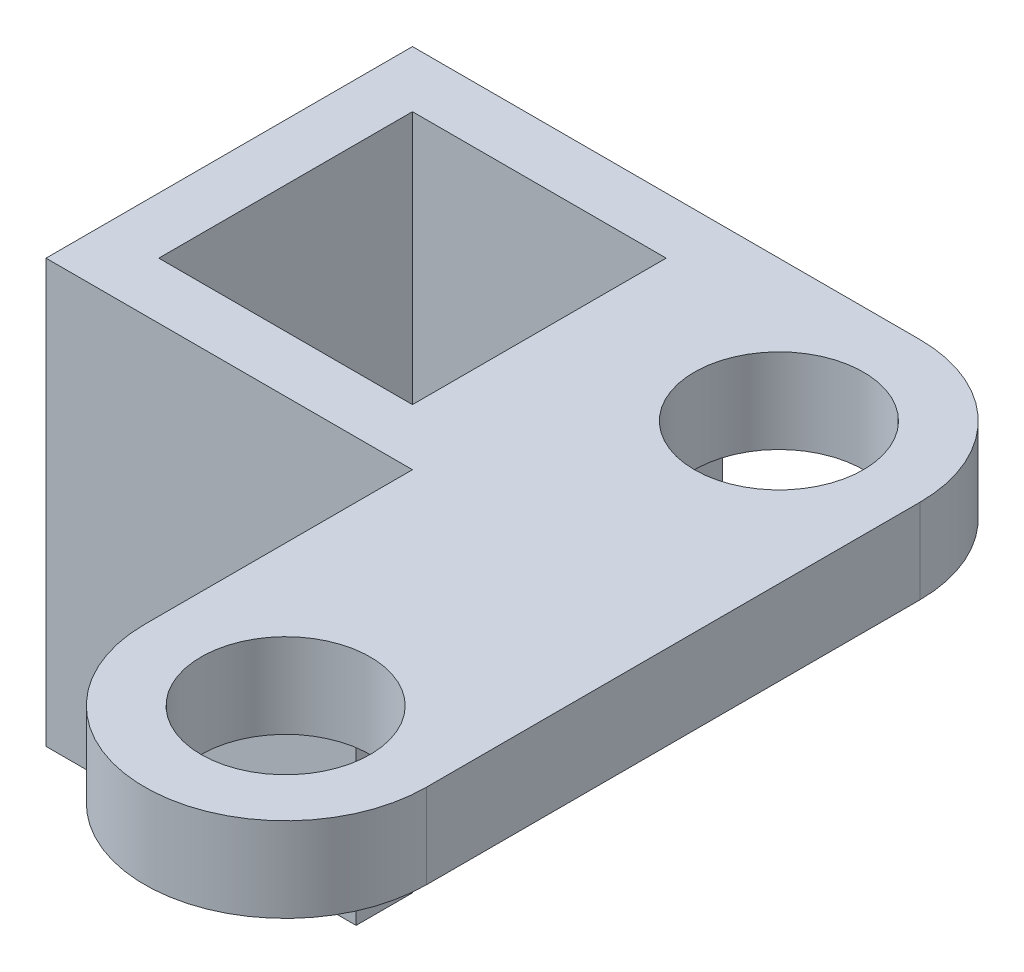
ISO-10303-21;
HEADER;
FILE_DESCRIPTION(('STEP AP214'),'2;1');
FILE_NAME('part.step','',(''),(''),'','','');
FILE_SCHEMA(('AUTOMOTIVE_DESIGN { 1 0 10303 214 1 1 1 1 }'));
ENDSEC;
DATA;
#1=APPLICATION_CONTEXT('core data for automotive mechanical design processes');
#2=APPLICATION_PROTOCOL_DEFINITION('international standard','automotive_design',2000,#1);
#3=PRODUCT_CONTEXT('',#1,'mechanical');
#4=PRODUCT('Part','Part','',(#3));
#5=PRODUCT_RELATED_PRODUCT_CATEGORY('part','',(#4));
#6=PRODUCT_DEFINITION_FORMATION('','',#4);
#7=PRODUCT_DEFINITION_CONTEXT('part definition',#1,'design');
#8=PRODUCT_DEFINITION('design','',#6,#7);
#9=PRODUCT_DEFINITION_SHAPE('','',#8);
#10=(LENGTH_UNIT() NAMED_UNIT(*) SI_UNIT(.MILLI.,.METRE.));
#11=(NAMED_UNIT(*) PLANE_ANGLE_UNIT() SI_UNIT($,.RADIAN.));
#12=(NAMED_UNIT(*) SI_UNIT($,.STERADIAN.) SOLID_ANGLE_UNIT());
#13=UNCERTAINTY_MEASURE_WITH_UNIT(LENGTH_MEASURE(1.E-05),#10,'distance_accuracy_value','');
#14=(GEOMETRIC_REPRESENTATION_CONTEXT(3) GLOBAL_UNCERTAINTY_ASSIGNED_CONTEXT((#13)) GLOBAL_UNIT_ASSIGNED_CONTEXT((#10,
#11,#12)) REPRESENTATION_CONTEXT('',''));
#15=CARTESIAN_POINT('',(0.,0.,0.));
#16=DIRECTION('',(0.,0.,1.));
#17=DIRECTION('',(1.,0.,0.));
#18=AXIS2_PLACEMENT_3D('',#15,#16,#17);
#19=CARTESIAN_POINT('',(1.73026563534961,3.,-9.65427227262373));
#20=DIRECTION('',(0.,-1.,0.));
#21=DIRECTION('',(0.,0.,-1.));
#22=AXIS2_PLACEMENT_3D('',#19,#20,#21);
#23=CYLINDRICAL_SURFACE('',#22,5.);
#24=DIRECTION('',(0.,-1.,0.));
#25=VECTOR('',#24,1.);
#26=CARTESIAN_POINT('',(1.73026563534961,3.,-14.6542722726237));
#27=LINE('',#26,#25);
#28=CARTESIAN_POINT('',(1.73026563534961,3.,-14.6542722726237));
#29=VERTEX_POINT('',#28);
#30=CARTESIAN_POINT('',(1.73026563534961,0.,-14.6542722726237));
#31=VERTEX_POINT('',#30);
#32=EDGE_CURVE('E58',#29,#31,#27,.T.);
#33=ORIENTED_EDGE('',*,*,#32,.F.);
#34=CARTESIAN_POINT('',(1.73026563534961,3.,-9.65427227262373));
#35=DIRECTION('',(0.,1.,0.));
#36=DIRECTION('',(0.,0.,-1.));
#37=AXIS2_PLACEMENT_3D('',#34,#35,#36);
#38=CIRCLE('',#37,5.);
#39=CARTESIAN_POINT('',(6.73026563534961,3.,-9.65427227262373));
#40=VERTEX_POINT('',#39);
#41=EDGE_CURVE('E247',#40,#29,#38,.T.);
#42=ORIENTED_EDGE('',*,*,#41,.F.);
#43=DIRECTION('',(0.,-1.,0.));
#44=VECTOR('',#43,1.);
#45=CARTESIAN_POINT('',(6.73026563534961,3.,-9.65427227262373));
#46=LINE('',#45,#44);
#47=CARTESIAN_POINT('',(6.73026563534961,0.,-9.65427227262373));
#48=VERTEX_POINT('',#47);
#49=EDGE_CURVE('E42',#40,#48,#46,.T.);
#50=ORIENTED_EDGE('',*,*,#49,.T.);
#51=CARTESIAN_POINT('',(1.73026563534961,0.,-9.65427227262373));
#52=DIRECTION('',(0.,1.,0.));
#53=DIRECTION('',(0.,0.,-1.));
#54=AXIS2_PLACEMENT_3D('',#51,#52,#53);
#55=CIRCLE('',#54,5.);
#56=EDGE_CURVE('E244',#48,#31,#55,.T.);
#57=ORIENTED_EDGE('',*,*,#56,.T.);
#58=EDGE_LOOP('',(#33,#42,#50,#57));
#59=FACE_BOUND('',#58,.T.);
#60=ADVANCED_FACE('F33',(#59),#23,.T.);
#61=CARTESIAN_POINT('',(1.73026563534961,3.,7.84572772737627));
#62=DIRECTION('',(0.,-1.,0.));
#63=DIRECTION('',(0.,0.,-1.));
#64=AXIS2_PLACEMENT_3D('',#61,#62,#63);
#65=PLANE('',#64);
#66=CARTESIAN_POINT('',(1.73026563534961,3.,-9.65427227262373));
#67=DIRECTION('',(0.,1.,0.));
#68=DIRECTION('',(0.,0.,1.));
#69=AXIS2_PLACEMENT_3D('',#66,#67,#68);
#70=CIRCLE('',#69,3.);
#71=CARTESIAN_POINT('',(1.73026563534961,3.,-6.65427227262373));
#72=VERTEX_POINT('',#71);
#73=EDGE_CURVE('E268',#72,#72,#70,.T.);
#74=ORIENTED_EDGE('',*,*,#73,.F.);
#75=EDGE_LOOP('',(#74));
#76=FACE_BOUND('',#75,.T.);
#77=CARTESIAN_POINT('',(1.73026563534961,3.,7.84572772737627));
#78=DIRECTION('',(0.,1.,0.));
#79=DIRECTION('',(0.,0.,-1.));
#80=AXIS2_PLACEMENT_3D('',#77,#78,#79);
#81=CIRCLE('',#80,5.);
#82=CARTESIAN_POINT('',(-3.26973436465039,3.,7.84572772737627));
#83=VERTEX_POINT('',#82);
#84=CARTESIAN_POINT('',(6.73026563534961,3.,7.84572772737627));
#85=VERTEX_POINT('',#84);
#86=EDGE_CURVE('E253',#83,#85,#81,.T.);
#87=ORIENTED_EDGE('',*,*,#86,.T.);
#88=DIRECTION('',(0.,0.,-1.));
#89=VECTOR('',#88,1.);
#90=CARTESIAN_POINT('',(6.73026563534961,3.,-9.65427227262373));
#91=LINE('',#90,#89);
#92=EDGE_CURVE('E289',#85,#40,#91,.T.);
#93=ORIENTED_EDGE('',*,*,#92,.T.);
#94=ORIENTED_EDGE('',*,*,#41,.T.);
#95=DIRECTION('',(1.,0.,0.));
#96=VECTOR('',#95,1.);
#97=CARTESIAN_POINT('',(1.73026563534961,3.,-14.6542722726237));
#98=LINE('',#97,#96);
#99=CARTESIAN_POINT('',(-16.2697343646504,3.,-14.6542722726237));
#100=VERTEX_POINT('',#99);
#101=EDGE_CURVE('E263',#100,#29,#98,.T.);
#102=ORIENTED_EDGE('',*,*,#101,.F.);
#103=DIRECTION('',(0.,0.,-1.));
#104=VECTOR('',#103,1.);
#105=CARTESIAN_POINT('',(-16.2697343646504,3.,-14.6542722726237));
#106=LINE('',#105,#104);
#107=CARTESIAN_POINT('',(-16.2697343646504,3.,-1.65427227262373));
#108=VERTEX_POINT('',#107);
#109=EDGE_CURVE('E326',#108,#100,#106,.T.);
#110=ORIENTED_EDGE('',*,*,#109,.F.);
#111=DIRECTION('',(-1.,0.,0.));
#112=VECTOR('',#111,1.);
#113=CARTESIAN_POINT('',(-16.2697343646504,3.,-1.65427227262373));
#114=LINE('',#113,#112);
#115=CARTESIAN_POINT('',(-3.26973436465039,3.,-1.65427227262373));
#116=VERTEX_POINT('',#115);
#117=EDGE_CURVE('E325',#116,#108,#114,.T.);
#118=ORIENTED_EDGE('',*,*,#117,.F.);
#119=DIRECTION('',(0.,0.,1.));
#120=VECTOR('',#119,1.);
#121=CARTESIAN_POINT('',(-3.26973436465039,3.,7.84572772737627));
#122=LINE('',#121,#120);
#123=EDGE_CURVE('E258',#116,#83,#122,.T.);
#124=ORIENTED_EDGE('',*,*,#123,.T.);
#125=EDGE_LOOP('',(#87,#93,#94,#102,#110,#118,#124));
#126=FACE_BOUND('',#125,.T.);
#127=CARTESIAN_POINT('',(1.73026563534961,3.,7.84572772737627));
#128=DIRECTION('',(0.,1.,0.));
#129=DIRECTION('',(0.,0.,1.));
#130=AXIS2_PLACEMENT_3D('',#127,#128,#129);
#131=CIRCLE('',#130,3.);
#132=CARTESIAN_POINT('',(1.73026563534961,3.,10.8457277273763));
#133=VERTEX_POINT('',#132);
#134=EDGE_CURVE('E282',#133,#133,#131,.T.);
#135=ORIENTED_EDGE('',*,*,#134,.F.);
#136=EDGE_LOOP('',(#135));
#137=FACE_BOUND('',#136,.T.);
#138=DIRECTION('',(-1.,0.,0.));
#139=VECTOR('',#138,1.);
#140=CARTESIAN_POINT('',(-5.26973436465039,3.,-3.65427227262373));
#141=LINE('',#140,#139);
#142=CARTESIAN_POINT('',(-5.26973436465039,3.,-3.65427227262373));
#143=VERTEX_POINT('',#142);
#144=CARTESIAN_POINT('',(-14.2697343646504,3.,-3.65427227262373));
#145=VERTEX_POINT('',#144);
#146=EDGE_CURVE('E152',#143,#145,#141,.T.);
#147=ORIENTED_EDGE('',*,*,#146,.T.);
#148=DIRECTION('',(0.,0.,-1.));
#149=VECTOR('',#148,1.);
#150=CARTESIAN_POINT('',(-14.2697343646504,3.,-3.65427227262373));
#151=LINE('',#150,#149);
#152=CARTESIAN_POINT('',(-14.2697343646504,3.,-12.6542722726237));
#153=VERTEX_POINT('',#152);
#154=EDGE_CURVE('E317',#145,#153,#151,.T.);
#155=ORIENTED_EDGE('',*,*,#154,.T.);
#156=DIRECTION('',(1.,0.,0.));
#157=VECTOR('',#156,1.);
#158=CARTESIAN_POINT('',(-5.26973436465039,3.,-12.6542722726237));
#159=LINE('',#158,#157);
#160=CARTESIAN_POINT('',(-5.26973436465039,3.,-12.6542722726237));
#161=VERTEX_POINT('',#160);
#162=EDGE_CURVE('E147',#153,#161,#159,.T.);
#163=ORIENTED_EDGE('',*,*,#162,.T.);
#164=DIRECTION('',(0.,0.,1.));
#165=VECTOR('',#164,1.);
#166=CARTESIAN_POINT('',(-5.26973436465039,3.,-3.65427227262373));
#167=LINE('',#166,#165);
#168=EDGE_CURVE('E492',#161,#143,#167,.T.);
#169=ORIENTED_EDGE('',*,*,#168,.T.);
#170=EDGE_LOOP('',(#147,#155,#163,#169));
#171=FACE_BOUND('',#170,.T.);
#172=ADVANCED_FACE('F216',(#76,#126,#137,#171),#65,.F.);
#173=CARTESIAN_POINT('',(1.73026563534961,0.,7.84572772737627));
#174=DIRECTION('',(0.,-1.,0.));
#175=DIRECTION('',(0.,0.,-1.));
#176=AXIS2_PLACEMENT_3D('',#173,#174,#175);
#177=PLANE('',#176);
#178=DIRECTION('',(0.,0.,1.));
#179=VECTOR('',#178,1.);
#180=CARTESIAN_POINT('',(-5.26973436465039,0.,-12.6542722726237));
#181=LINE('',#180,#179);
#182=CARTESIAN_POINT('',(-5.26973436465039,0.,-14.6542722726237));
#183=VERTEX_POINT('',#182);
#184=CARTESIAN_POINT('',(-5.26973436465039,0.,-12.6542722726237));
#185=VERTEX_POINT('',#184);
#186=EDGE_CURVE('E50',#183,#185,#181,.T.);
#187=ORIENTED_EDGE('',*,*,#186,.F.);
#188=DIRECTION('',(1.,0.,0.));
#189=VECTOR('',#188,1.);
#190=CARTESIAN_POINT('',(1.73026563534961,0.,-14.6542722726237));
#191=LINE('',#190,#189);
#192=EDGE_CURVE('E190',#183,#31,#191,.T.);
#193=ORIENTED_EDGE('',*,*,#192,.T.);
#194=ORIENTED_EDGE('',*,*,#56,.F.);
#195=DIRECTION('',(0.,0.,-1.));
#196=VECTOR('',#195,1.);
#197=CARTESIAN_POINT('',(6.73026563534961,0.,-9.65427227262373));
#198=LINE('',#197,#196);
#199=CARTESIAN_POINT('',(6.73026563534961,0.,7.84572772737627));
#200=VERTEX_POINT('',#199);
#201=EDGE_CURVE('E238',#200,#48,#198,.T.);
#202=ORIENTED_EDGE('',*,*,#201,.F.);
#203=CARTESIAN_POINT('',(1.73026563534961,0.,7.84572772737627));
#204=DIRECTION('',(0.,1.,0.));
#205=DIRECTION('',(0.,0.,-1.));
#206=AXIS2_PLACEMENT_3D('',#203,#204,#205);
#207=CIRCLE('',#206,5.);
#208=CARTESIAN_POINT('',(-3.26973436465039,0.,7.84572772737627));
#209=VERTEX_POINT('',#208);
#210=EDGE_CURVE('E245',#209,#200,#207,.T.);
#211=ORIENTED_EDGE('',*,*,#210,.F.);
#212=DIRECTION('',(0.,0.,1.));
#213=VECTOR('',#212,1.);
#214=CARTESIAN_POINT('',(-3.26973436465039,0.,7.84572772737627));
#215=LINE('',#214,#213);
#216=CARTESIAN_POINT('',(-3.26973436465039,0.,-1.65427227262373));
#217=VERTEX_POINT('',#216);
#218=EDGE_CURVE('E251',#217,#209,#215,.T.);
#219=ORIENTED_EDGE('',*,*,#218,.F.);
#220=DIRECTION('',(-1.,0.,0.));
#221=VECTOR('',#220,1.);
#222=CARTESIAN_POINT('',(-16.2697343646504,0.,-1.65427227262373));
#223=LINE('',#222,#221);
#224=CARTESIAN_POINT('',(-5.26973436465039,0.,-1.65427227262373));
#225=VERTEX_POINT('',#224);
#226=EDGE_CURVE('E259',#217,#225,#223,.T.);
#227=ORIENTED_EDGE('',*,*,#226,.T.);
#228=DIRECTION('',(0.,0.,1.));
#229=VECTOR('',#228,1.);
#230=CARTESIAN_POINT('',(-5.26973436465039,0.,-1.65427227262373));
#231=LINE('',#230,#229);
#232=CARTESIAN_POINT('',(-5.26973436465039,0.,-3.65427227262373));
#233=VERTEX_POINT('',#232);
#234=EDGE_CURVE('E167',#233,#225,#231,.T.);
#235=ORIENTED_EDGE('',*,*,#234,.F.);
#236=DIRECTION('',(0.,0.,1.));
#237=VECTOR('',#236,1.);
#238=CARTESIAN_POINT('',(-5.26973436465039,0.,-3.65427227262373));
#239=LINE('',#238,#237);
#240=EDGE_CURVE('E307',#185,#233,#239,.T.);
#241=ORIENTED_EDGE('',*,*,#240,.F.);
#242=EDGE_LOOP('',(#187,#193,#194,#202,#211,#219,#227,#235,#241));
#243=FACE_BOUND('',#242,.T.);
#244=CARTESIAN_POINT('',(1.73026563534961,0.,-9.65427227262373));
#245=DIRECTION('',(0.,1.,0.));
#246=DIRECTION('',(0.,0.,1.));
#247=AXIS2_PLACEMENT_3D('',#244,#245,#246);
#248=CIRCLE('',#247,3.);
#249=CARTESIAN_POINT('',(1.73026563534961,0.,-6.65427227262373));
#250=VERTEX_POINT('',#249);
#251=EDGE_CURVE('E276',#250,#250,#248,.T.);
#252=ORIENTED_EDGE('',*,*,#251,.T.);
#253=EDGE_LOOP('',(#252));
#254=FACE_BOUND('',#253,.T.);
#255=CARTESIAN_POINT('',(1.73026563534961,0.,7.84572772737627));
#256=DIRECTION('',(0.,1.,0.));
#257=DIRECTION('',(0.,0.,1.));
#258=AXIS2_PLACEMENT_3D('',#255,#256,#257);
#259=CIRCLE('',#258,3.);
#260=CARTESIAN_POINT('',(1.73026563534961,0.,10.8457277273763));
#261=VERTEX_POINT('',#260);
#262=EDGE_CURVE('E279',#261,#261,#259,.T.);
#263=ORIENTED_EDGE('',*,*,#262,.T.);
#264=EDGE_LOOP('',(#263));
#265=FACE_BOUND('',#264,.T.);
#266=ADVANCED_FACE('F221',(#243,#254,#265),#177,.T.);
#267=CARTESIAN_POINT('',(1.73026563534961,3.,7.84572772737627));
#268=DIRECTION('',(0.,-1.,0.));
#269=DIRECTION('',(0.,0.,-1.));
#270=AXIS2_PLACEMENT_3D('',#267,#268,#269);
#271=CYLINDRICAL_SURFACE('',#270,5.);
#272=ORIENTED_EDGE('',*,*,#210,.T.);
#273=DIRECTION('',(0.,-1.,0.));
#274=VECTOR('',#273,1.);
#275=CARTESIAN_POINT('',(6.73026563534961,3.,7.84572772737627));
#276=LINE('',#275,#274);
#277=EDGE_CURVE('E11',#85,#200,#276,.T.);
#278=ORIENTED_EDGE('',*,*,#277,.F.);
#279=ORIENTED_EDGE('',*,*,#86,.F.);
#280=DIRECTION('',(0.,-1.,0.));
#281=VECTOR('',#280,1.);
#282=CARTESIAN_POINT('',(-3.26973436465039,3.,7.84572772737627));
#283=LINE('',#282,#281);
#284=EDGE_CURVE('E248',#83,#209,#283,.T.);
#285=ORIENTED_EDGE('',*,*,#284,.T.);
#286=EDGE_LOOP('',(#272,#278,#279,#285));
#287=FACE_BOUND('',#286,.T.);
#288=ADVANCED_FACE('F35',(#287),#271,.T.);
#289=CARTESIAN_POINT('',(6.73026563534961,3.,-9.65427227262373));
#290=DIRECTION('',(-1.,0.,0.));
#291=DIRECTION('',(0.,0.,1.));
#292=AXIS2_PLACEMENT_3D('',#289,#290,#291);
#293=PLANE('',#292);
#294=ORIENTED_EDGE('',*,*,#201,.T.);
#295=ORIENTED_EDGE('',*,*,#49,.F.);
#296=ORIENTED_EDGE('',*,*,#92,.F.);
#297=ORIENTED_EDGE('',*,*,#277,.T.);
#298=EDGE_LOOP('',(#294,#295,#296,#297));
#299=FACE_BOUND('',#298,.T.);
#300=ADVANCED_FACE('F227',(#299),#293,.F.);
#301=CARTESIAN_POINT('',(-3.26973436465039,3.,7.84572772737627));
#302=DIRECTION('',(1.,0.,0.));
#303=DIRECTION('',(0.,0.,-1.));
#304=AXIS2_PLACEMENT_3D('',#301,#302,#303);
#305=PLANE('',#304);
#306=ORIENTED_EDGE('',*,*,#123,.F.);
#307=DIRECTION('',(0.,-1.,0.));
#308=VECTOR('',#307,1.);
#309=CARTESIAN_POINT('',(-3.26973436465039,3.,-1.65427227262373));
#310=LINE('',#309,#308);
#311=EDGE_CURVE('E273',#116,#217,#310,.T.);
#312=ORIENTED_EDGE('',*,*,#311,.T.);
#313=ORIENTED_EDGE('',*,*,#218,.T.);
#314=ORIENTED_EDGE('',*,*,#284,.F.);
#315=EDGE_LOOP('',(#306,#312,#313,#314));
#316=FACE_BOUND('',#315,.T.);
#317=ADVANCED_FACE('F225',(#316),#305,.F.);
#318=CARTESIAN_POINT('',(1.73026563534961,3.,7.84572772737627));
#319=DIRECTION('',(0.,-1.,0.));
#320=DIRECTION('',(0.,0.,-1.));
#321=AXIS2_PLACEMENT_3D('',#318,#319,#320);
#322=CYLINDRICAL_SURFACE('',#321,3.);
#323=ORIENTED_EDGE('',*,*,#134,.T.);
#324=EDGE_LOOP('',(#323));
#325=FACE_BOUND('',#324,.T.);
#326=ORIENTED_EDGE('',*,*,#262,.F.);
#327=EDGE_LOOP('',(#326));
#328=FACE_BOUND('',#327,.T.);
#329=ADVANCED_FACE('F234',(#325,#328),#322,.F.);
#330=CARTESIAN_POINT('',(1.73026563534961,0.,-9.65427227262373));
#331=DIRECTION('',(0.,1.,0.));
#332=DIRECTION('',(0.,0.,1.));
#333=AXIS2_PLACEMENT_3D('',#330,#331,#332);
#334=CYLINDRICAL_SURFACE('',#333,3.);
#335=ORIENTED_EDGE('',*,*,#251,.F.);
#336=EDGE_LOOP('',(#335));
#337=FACE_BOUND('',#336,.T.);
#338=ORIENTED_EDGE('',*,*,#73,.T.);
#339=EDGE_LOOP('',(#338));
#340=FACE_BOUND('',#339,.T.);
#341=ADVANCED_FACE('F346',(#337,#340),#334,.F.);
#342=CARTESIAN_POINT('',(1.73026563534961,3.,-14.6542722726237));
#343=DIRECTION('',(0.,0.,-1.));
#344=DIRECTION('',(-1.,0.,0.));
#345=AXIS2_PLACEMENT_3D('',#342,#343,#344);
#346=PLANE('',#345);
#347=ORIENTED_EDGE('',*,*,#192,.F.);
#348=DIRECTION('',(0.,1.,0.));
#349=VECTOR('',#348,1.);
#350=CARTESIAN_POINT('',(-5.26973436465039,-12.,-14.6542722726237));
#351=LINE('',#350,#349);
#352=CARTESIAN_POINT('',(-5.26973436465039,-12.,-14.6542722726237));
#353=VERTEX_POINT('',#352);
#354=EDGE_CURVE('E197',#353,#183,#351,.T.);
#355=ORIENTED_EDGE('',*,*,#354,.F.);
#356=DIRECTION('',(1.,0.,0.));
#357=VECTOR('',#356,1.);
#358=CARTESIAN_POINT('',(-5.26973436465039,-12.,-14.6542722726237));
#359=LINE('',#358,#357);
#360=CARTESIAN_POINT('',(-16.2697343646504,-12.,-14.6542722726237));
#361=VERTEX_POINT('',#360);
#362=EDGE_CURVE('E179',#361,#353,#359,.T.);
#363=ORIENTED_EDGE('',*,*,#362,.F.);
#364=DIRECTION('',(0.,-1.,0.));
#365=VECTOR('',#364,1.);
#366=CARTESIAN_POINT('',(-16.2697343646504,3.,-14.6542722726237));
#367=LINE('',#366,#365);
#368=EDGE_CURVE('E269',#100,#361,#367,.T.);
#369=ORIENTED_EDGE('',*,*,#368,.F.);
#370=ORIENTED_EDGE('',*,*,#101,.T.);
#371=ORIENTED_EDGE('',*,*,#32,.T.);
#372=EDGE_LOOP('',(#347,#355,#363,#369,#370,#371));
#373=FACE_BOUND('',#372,.T.);
#374=ADVANCED_FACE('F333',(#373),#346,.T.);
#375=CARTESIAN_POINT('',(-16.2697343646504,3.,-14.6542722726237));
#376=DIRECTION('',(-1.,0.,0.));
#377=DIRECTION('',(0.,0.,1.));
#378=AXIS2_PLACEMENT_3D('',#375,#376,#377);
#379=PLANE('',#378);
#380=ORIENTED_EDGE('',*,*,#368,.T.);
#381=DIRECTION('',(0.,0.,-1.));
#382=VECTOR('',#381,1.);
#383=CARTESIAN_POINT('',(-16.2697343646504,-12.,-14.6542722726237));
#384=LINE('',#383,#382);
#385=CARTESIAN_POINT('',(-16.2697343646504,-12.,-1.65427227262373));
#386=VERTEX_POINT('',#385);
#387=EDGE_CURVE('E176',#386,#361,#384,.T.);
#388=ORIENTED_EDGE('',*,*,#387,.F.);
#389=DIRECTION('',(0.,-1.,0.));
#390=VECTOR('',#389,1.);
#391=CARTESIAN_POINT('',(-16.2697343646504,3.,-1.65427227262373));
#392=LINE('',#391,#390);
#393=EDGE_CURVE('E271',#108,#386,#392,.T.);
#394=ORIENTED_EDGE('',*,*,#393,.F.);
#395=ORIENTED_EDGE('',*,*,#109,.T.);
#396=EDGE_LOOP('',(#380,#388,#394,#395));
#397=FACE_BOUND('',#396,.T.);
#398=ADVANCED_FACE('F338',(#397),#379,.T.);
#399=CARTESIAN_POINT('',(-16.2697343646504,3.,-1.65427227262373));
#400=DIRECTION('',(0.,0.,1.));
#401=DIRECTION('',(1.,0.,0.));
#402=AXIS2_PLACEMENT_3D('',#399,#400,#401);
#403=PLANE('',#402);
#404=ORIENTED_EDGE('',*,*,#226,.F.);
#405=ORIENTED_EDGE('',*,*,#311,.F.);
#406=ORIENTED_EDGE('',*,*,#117,.T.);
#407=ORIENTED_EDGE('',*,*,#393,.T.);
#408=DIRECTION('',(-1.,0.,0.));
#409=VECTOR('',#408,1.);
#410=CARTESIAN_POINT('',(-16.2697343646504,-12.,-1.65427227262373));
#411=LINE('',#410,#409);
#412=CARTESIAN_POINT('',(-5.26973436465039,-12.,-1.65427227262373));
#413=VERTEX_POINT('',#412);
#414=EDGE_CURVE('E173',#413,#386,#411,.T.);
#415=ORIENTED_EDGE('',*,*,#414,.F.);
#416=DIRECTION('',(0.,1.,0.));
#417=VECTOR('',#416,1.);
#418=CARTESIAN_POINT('',(-5.26973436465039,-12.,-1.65427227262373));
#419=LINE('',#418,#417);
#420=EDGE_CURVE('E193',#413,#225,#419,.T.);
#421=ORIENTED_EDGE('',*,*,#420,.T.);
#422=EDGE_LOOP('',(#404,#405,#406,#407,#415,#421));
#423=FACE_BOUND('',#422,.T.);
#424=ADVANCED_FACE('F299',(#423),#403,.T.);
#425=CARTESIAN_POINT('',(-14.2697343646504,3.,-3.65427227262373));
#426=DIRECTION('',(-1.,0.,0.));
#427=DIRECTION('',(0.,0.,1.));
#428=AXIS2_PLACEMENT_3D('',#425,#426,#427);
#429=PLANE('',#428);
#430=DIRECTION('',(0.,-1.,0.));
#431=VECTOR('',#430,1.);
#432=CARTESIAN_POINT('',(-14.2697343646504,3.,-3.65427227262373));
#433=LINE('',#432,#431);
#434=CARTESIAN_POINT('',(-14.2697343646504,-12.,-3.65427227262373));
#435=VERTEX_POINT('',#434);
#436=EDGE_CURVE('E157',#145,#435,#433,.T.);
#437=ORIENTED_EDGE('',*,*,#436,.T.);
#438=DIRECTION('',(0.,0.,1.));
#439=VECTOR('',#438,1.);
#440=CARTESIAN_POINT('',(-14.2697343646504,-12.,-3.65427227262373));
#441=LINE('',#440,#439);
#442=CARTESIAN_POINT('',(-14.2697343646504,-12.,-12.6542722726237));
#443=VERTEX_POINT('',#442);
#444=EDGE_CURVE('E155',#443,#435,#441,.T.);
#445=ORIENTED_EDGE('',*,*,#444,.F.);
#446=DIRECTION('',(0.,-1.,0.));
#447=VECTOR('',#446,1.);
#448=CARTESIAN_POINT('',(-14.2697343646504,3.,-12.6542722726237));
#449=LINE('',#448,#447);
#450=EDGE_CURVE('E139',#153,#443,#449,.T.);
#451=ORIENTED_EDGE('',*,*,#450,.F.);
#452=ORIENTED_EDGE('',*,*,#154,.F.);
#453=EDGE_LOOP('',(#437,#445,#451,#452));
#454=FACE_BOUND('',#453,.T.);
#455=ADVANCED_FACE('F156',(#454),#429,.F.);
#456=CARTESIAN_POINT('',(-5.26973436465039,3.,-3.65427227262373));
#457=DIRECTION('',(0.,0.,1.));
#458=DIRECTION('',(1.,0.,0.));
#459=AXIS2_PLACEMENT_3D('',#456,#457,#458);
#460=PLANE('',#459);
#461=DIRECTION('',(0.,-1.,0.));
#462=VECTOR('',#461,1.);
#463=CARTESIAN_POINT('',(-5.26973436465039,3.,-3.65427227262373));
#464=LINE('',#463,#462);
#465=EDGE_CURVE('E310',#143,#233,#464,.T.);
#466=ORIENTED_EDGE('',*,*,#465,.T.);
#467=DIRECTION('',(0.,1.,0.));
#468=VECTOR('',#467,1.);
#469=CARTESIAN_POINT('',(-5.26973436465039,-12.,-3.65427227262373));
#470=LINE('',#469,#468);
#471=CARTESIAN_POINT('',(-5.26973436465039,-12.,-3.65427227262373));
#472=VERTEX_POINT('',#471);
#473=EDGE_CURVE('E196',#472,#233,#470,.T.);
#474=ORIENTED_EDGE('',*,*,#473,.F.);
#475=DIRECTION('',(1.,0.,0.));
#476=VECTOR('',#475,1.);
#477=CARTESIAN_POINT('',(-5.26973436465039,-12.,-3.65427227262373));
#478=LINE('',#477,#476);
#479=EDGE_CURVE('E160',#435,#472,#478,.T.);
#480=ORIENTED_EDGE('',*,*,#479,.F.);
#481=ORIENTED_EDGE('',*,*,#436,.F.);
#482=ORIENTED_EDGE('',*,*,#146,.F.);
#483=EDGE_LOOP('',(#466,#474,#480,#481,#482));
#484=FACE_BOUND('',#483,.T.);
#485=ADVANCED_FACE('F311',(#484),#460,.F.);
#486=CARTESIAN_POINT('',(-5.26973436465039,3.,-3.65427227262373));
#487=DIRECTION('',(1.,0.,0.));
#488=DIRECTION('',(0.,0.,-1.));
#489=AXIS2_PLACEMENT_3D('',#486,#487,#488);
#490=PLANE('',#489);
#491=ORIENTED_EDGE('',*,*,#240,.T.);
#492=ORIENTED_EDGE('',*,*,#465,.F.);
#493=ORIENTED_EDGE('',*,*,#168,.F.);
#494=DIRECTION('',(0.,-1.,0.));
#495=VECTOR('',#494,1.);
#496=CARTESIAN_POINT('',(-5.26973436465039,3.,-12.6542722726237));
#497=LINE('',#496,#495);
#498=EDGE_CURVE('E151',#161,#185,#497,.T.);
#499=ORIENTED_EDGE('',*,*,#498,.T.);
#500=EDGE_LOOP('',(#491,#492,#493,#499));
#501=FACE_BOUND('',#500,.T.);
#502=ADVANCED_FACE('F316',(#501),#490,.F.);
#503=CARTESIAN_POINT('',(-5.26973436465039,3.,-12.6542722726237));
#504=DIRECTION('',(0.,0.,-1.));
#505=DIRECTION('',(-1.,0.,0.));
#506=AXIS2_PLACEMENT_3D('',#503,#504,#505);
#507=PLANE('',#506);
#508=ORIENTED_EDGE('',*,*,#450,.T.);
#509=DIRECTION('',(-1.,0.,0.));
#510=VECTOR('',#509,1.);
#511=CARTESIAN_POINT('',(-14.2697343646504,-12.,-12.6542722726237));
#512=LINE('',#511,#510);
#513=CARTESIAN_POINT('',(-5.26973436465039,-12.,-12.6542722726237));
#514=VERTEX_POINT('',#513);
#515=EDGE_CURVE('E144',#514,#443,#512,.T.);
#516=ORIENTED_EDGE('',*,*,#515,.F.);
#517=DIRECTION('',(0.,1.,0.));
#518=VECTOR('',#517,1.);
#519=CARTESIAN_POINT('',(-5.26973436465039,-12.,-12.6542722726237));
#520=LINE('',#519,#518);
#521=EDGE_CURVE('E182',#514,#185,#520,.T.);
#522=ORIENTED_EDGE('',*,*,#521,.T.);
#523=ORIENTED_EDGE('',*,*,#498,.F.);
#524=ORIENTED_EDGE('',*,*,#162,.F.);
#525=EDGE_LOOP('',(#508,#516,#522,#523,#524));
#526=FACE_BOUND('',#525,.T.);
#527=ADVANCED_FACE('F141',(#526),#507,.F.);
#528=CARTESIAN_POINT('',(-5.26973436465039,-12.,-1.65427227262373));
#529=DIRECTION('',(-1.,0.,0.));
#530=DIRECTION('',(0.,0.,1.));
#531=AXIS2_PLACEMENT_3D('',#528,#529,#530);
#532=PLANE('',#531);
#533=ORIENTED_EDGE('',*,*,#234,.T.);
#534=ORIENTED_EDGE('',*,*,#420,.F.);
#535=DIRECTION('',(0.,0.,1.));
#536=VECTOR('',#535,1.);
#537=CARTESIAN_POINT('',(-5.26973436465039,-12.,-1.65427227262373));
#538=LINE('',#537,#536);
#539=EDGE_CURVE('E171',#472,#413,#538,.T.);
#540=ORIENTED_EDGE('',*,*,#539,.F.);
#541=ORIENTED_EDGE('',*,*,#473,.T.);
#542=EDGE_LOOP('',(#533,#534,#540,#541));
#543=FACE_BOUND('',#542,.T.);
#544=ADVANCED_FACE('F206',(#543),#532,.F.);
#545=CARTESIAN_POINT('',(-5.26973436465039,-12.,-12.6542722726237));
#546=DIRECTION('',(-1.,0.,0.));
#547=DIRECTION('',(0.,0.,1.));
#548=AXIS2_PLACEMENT_3D('',#545,#546,#547);
#549=PLANE('',#548);
#550=ORIENTED_EDGE('',*,*,#186,.T.);
#551=ORIENTED_EDGE('',*,*,#521,.F.);
#552=DIRECTION('',(0.,0.,1.));
#553=VECTOR('',#552,1.);
#554=CARTESIAN_POINT('',(-5.26973436465039,-12.,-12.6542722726237));
#555=LINE('',#554,#553);
#556=EDGE_CURVE('E164',#353,#514,#555,.T.);
#557=ORIENTED_EDGE('',*,*,#556,.F.);
#558=ORIENTED_EDGE('',*,*,#354,.T.);
#559=EDGE_LOOP('',(#550,#551,#557,#558));
#560=FACE_BOUND('',#559,.T.);
#561=ADVANCED_FACE('F204',(#560),#549,.F.);
#562=CARTESIAN_POINT('',(0.,-12.,0.));
#563=DIRECTION('',(0.,1.,0.));
#564=DIRECTION('',(0.,0.,1.));
#565=AXIS2_PLACEMENT_3D('',#562,#563,#564);
#566=PLANE('',#565);
#567=ORIENTED_EDGE('',*,*,#515,.T.);
#568=ORIENTED_EDGE('',*,*,#444,.T.);
#569=ORIENTED_EDGE('',*,*,#479,.T.);
#570=ORIENTED_EDGE('',*,*,#539,.T.);
#571=ORIENTED_EDGE('',*,*,#414,.T.);
#572=ORIENTED_EDGE('',*,*,#387,.T.);
#573=ORIENTED_EDGE('',*,*,#362,.T.);
#574=ORIENTED_EDGE('',*,*,#556,.T.);
#575=EDGE_LOOP('',(#567,#568,#569,#570,#571,#572,#573,#574));
#576=FACE_BOUND('',#575,.T.);
#577=ADVANCED_FACE('F162',(#576),#566,.F.);
#578=CLOSED_SHELL('',(#60,#172,#266,#288,#300,#317,#329,#341,#374,#398,#424,#455,#485,#502,#527,
#544,#561,#577));
#579=MANIFOLD_SOLID_BREP('B2',#578);
#580=ADVANCED_BREP_SHAPE_REPRESENTATION('',(#18,#579),#14);
#581=SHAPE_DEFINITION_REPRESENTATION(#9,#580);
ENDSEC;
END-ISO-10303-21;
